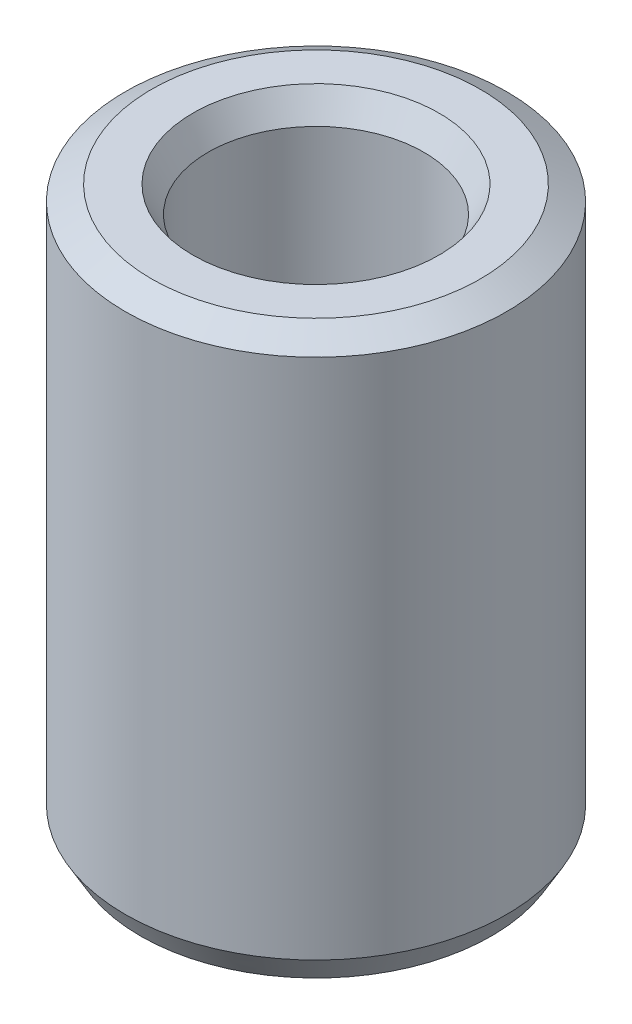
ISO-10303-21;
HEADER;
FILE_DESCRIPTION(('STEP AP214'),'2;1');
FILE_NAME('part.step','',(''),(''),'','','');
FILE_SCHEMA(('AUTOMOTIVE_DESIGN { 1 0 10303 214 1 1 1 1 }'));
ENDSEC;
DATA;
#1=APPLICATION_CONTEXT('core data for automotive mechanical design processes');
#2=APPLICATION_PROTOCOL_DEFINITION('international standard','automotive_design',2000,#1);
#3=PRODUCT_CONTEXT('',#1,'mechanical');
#4=PRODUCT('Part','Part','',(#3));
#5=PRODUCT_RELATED_PRODUCT_CATEGORY('part','',(#4));
#6=PRODUCT_DEFINITION_FORMATION('','',#4);
#7=PRODUCT_DEFINITION_CONTEXT('part definition',#1,'design');
#8=PRODUCT_DEFINITION('design','',#6,#7);
#9=PRODUCT_DEFINITION_SHAPE('','',#8);
#10=(LENGTH_UNIT() NAMED_UNIT(*) SI_UNIT(.MILLI.,.METRE.));
#11=(NAMED_UNIT(*) PLANE_ANGLE_UNIT() SI_UNIT($,.RADIAN.));
#12=(NAMED_UNIT(*) SI_UNIT($,.STERADIAN.) SOLID_ANGLE_UNIT());
#13=UNCERTAINTY_MEASURE_WITH_UNIT(LENGTH_MEASURE(1.E-05),#10,'distance_accuracy_value','');
#14=(GEOMETRIC_REPRESENTATION_CONTEXT(3) GLOBAL_UNCERTAINTY_ASSIGNED_CONTEXT((#13)) GLOBAL_UNIT_ASSIGNED_CONTEXT((#10,
#11,#12)) REPRESENTATION_CONTEXT('',''));
#15=CARTESIAN_POINT('',(0.,0.,0.));
#16=DIRECTION('',(0.,0.,1.));
#17=DIRECTION('',(1.,0.,0.));
#18=AXIS2_PLACEMENT_3D('',#15,#16,#17);
#19=CARTESIAN_POINT('',(0.,22.1694902343943,0.));
#20=DIRECTION('',(0.,-1.,0.));
#21=DIRECTION('',(0.,0.,-1.));
#22=AXIS2_PLACEMENT_3D('',#19,#20,#21);
#23=CYLINDRICAL_SURFACE('',#22,7.5);
#24=CARTESIAN_POINT('',(0.,1.03430108088074,0.));
#25=DIRECTION('',(0.,1.,0.));
#26=DIRECTION('',(0.,0.,1.));
#27=AXIS2_PLACEMENT_3D('',#24,#25,#26);
#28=CIRCLE('',#27,7.5);
#29=CARTESIAN_POINT('',(0.,1.03430108088074,7.5));
#30=VERTEX_POINT('',#29);
#31=EDGE_CURVE('E10',#30,#30,#28,.T.);
#32=ORIENTED_EDGE('',*,*,#31,.T.);
#33=EDGE_LOOP('',(#32));
#34=FACE_BOUND('',#33,.T.);
#35=CARTESIAN_POINT('',(0.,21.5723362269247,0.));
#36=DIRECTION('',(0.,1.,0.));
#37=DIRECTION('',(0.,0.,1.));
#38=AXIS2_PLACEMENT_3D('',#35,#36,#37);
#39=CIRCLE('',#38,7.5);
#40=CARTESIAN_POINT('',(0.,21.5723362269247,7.5));
#41=VERTEX_POINT('',#40);
#42=EDGE_CURVE('E50',#41,#41,#39,.F.);
#43=ORIENTED_EDGE('',*,*,#42,.T.);
#44=EDGE_LOOP('',(#43));
#45=FACE_BOUND('',#44,.T.);
#46=ADVANCED_FACE('F39',(#34,#45),#23,.T.);
#47=CARTESIAN_POINT('',(0.,22.1694902343943,0.));
#48=DIRECTION('',(0.,1.,0.));
#49=DIRECTION('',(0.,0.,1.));
#50=AXIS2_PLACEMENT_3D('',#47,#48,#49);
#51=PLANE('',#50);
#52=CARTESIAN_POINT('',(0.,22.1694902343943,0.));
#53=DIRECTION('',(0.,1.,0.));
#54=DIRECTION('',(0.,0.,1.));
#55=AXIS2_PLACEMENT_3D('',#52,#53,#54);
#56=CIRCLE('',#55,4.84151142337172);
#57=CARTESIAN_POINT('',(0.,22.1694902343943,4.84151142337172));
#58=VERTEX_POINT('',#57);
#59=EDGE_CURVE('E58',#58,#58,#56,.F.);
#60=ORIENTED_EDGE('',*,*,#59,.T.);
#61=EDGE_LOOP('',(#60));
#62=FACE_BOUND('',#61,.T.);
#63=CARTESIAN_POINT('',(0.,22.1694902343943,0.));
#64=DIRECTION('',(0.,1.,0.));
#65=DIRECTION('',(0.,0.,1.));
#66=AXIS2_PLACEMENT_3D('',#63,#64,#65);
#67=CIRCLE('',#66,6.46569891911926);
#68=CARTESIAN_POINT('',(0.,22.1694902343943,6.46569891911926));
#69=VERTEX_POINT('',#68);
#70=EDGE_CURVE('E61',#69,#69,#67,.T.);
#71=ORIENTED_EDGE('',*,*,#70,.T.);
#72=EDGE_LOOP('',(#71));
#73=FACE_BOUND('',#72,.T.);
#74=ADVANCED_FACE('F88',(#62,#73),#51,.T.);
#75=CARTESIAN_POINT('',(0.,0.,0.));
#76=DIRECTION('',(0.,1.,0.));
#77=DIRECTION('',(0.,0.,1.));
#78=AXIS2_PLACEMENT_3D('',#75,#76,#77);
#79=PLANE('',#78);
#80=CARTESIAN_POINT('',(0.,0.,0.));
#81=DIRECTION('',(0.,1.,0.));
#82=DIRECTION('',(0.,0.,1.));
#83=AXIS2_PLACEMENT_3D('',#80,#81,#82);
#84=CIRCLE('',#83,5.27865849678286);
#85=CARTESIAN_POINT('',(0.,0.,5.27865849678286));
#86=VERTEX_POINT('',#85);
#87=EDGE_CURVE('E51',#86,#86,#84,.T.);
#88=ORIENTED_EDGE('',*,*,#87,.T.);
#89=EDGE_LOOP('',(#88));
#90=FACE_BOUND('',#89,.T.);
#91=CARTESIAN_POINT('',(0.,0.,0.));
#92=DIRECTION('',(0.,1.,0.));
#93=DIRECTION('',(0.,0.,1.));
#94=AXIS2_PLACEMENT_3D('',#91,#92,#93);
#95=CIRCLE('',#94,6.90284599253038);
#96=CARTESIAN_POINT('',(0.,0.,6.90284599253038));
#97=VERTEX_POINT('',#96);
#98=EDGE_CURVE('E54',#97,#97,#95,.F.);
#99=ORIENTED_EDGE('',*,*,#98,.T.);
#100=EDGE_LOOP('',(#99));
#101=FACE_BOUND('',#100,.T.);
#102=ADVANCED_FACE('F83',(#90,#101),#79,.F.);
#103=CARTESIAN_POINT('',(0.,22.1694902343943,0.));
#104=DIRECTION('',(0.,-1.,0.));
#105=DIRECTION('',(0.,0.,-1.));
#106=AXIS2_PLACEMENT_3D('',#103,#104,#105);
#107=CYLINDRICAL_SURFACE('',#106,4.24435741590211);
#108=CARTESIAN_POINT('',(0.,21.1351891535136,0.));
#109=DIRECTION('',(0.,1.,0.));
#110=DIRECTION('',(0.,0.,1.));
#111=AXIS2_PLACEMENT_3D('',#108,#109,#110);
#112=CIRCLE('',#111,4.24435741590211);
#113=CARTESIAN_POINT('',(0.,21.1351891535136,4.24435741590211));
#114=VERTEX_POINT('',#113);
#115=EDGE_CURVE('E67',#114,#114,#112,.T.);
#116=ORIENTED_EDGE('',*,*,#115,.T.);
#117=EDGE_LOOP('',(#116));
#118=FACE_BOUND('',#117,.T.);
#119=CARTESIAN_POINT('',(0.,0.597154007469625,0.));
#120=DIRECTION('',(0.,1.,0.));
#121=DIRECTION('',(0.,0.,1.));
#122=AXIS2_PLACEMENT_3D('',#119,#120,#121);
#123=CIRCLE('',#122,4.24435741590211);
#124=CARTESIAN_POINT('',(0.,0.597154007469625,4.24435741590211));
#125=VERTEX_POINT('',#124);
#126=EDGE_CURVE('E69',#125,#125,#123,.F.);
#127=ORIENTED_EDGE('',*,*,#126,.T.);
#128=EDGE_LOOP('',(#127));
#129=FACE_BOUND('',#128,.T.);
#130=ADVANCED_FACE('F71',(#118,#129),#107,.F.);
#131=CARTESIAN_POINT('',(0.,21.1351891535136,0.));
#132=DIRECTION('',(0.,1.,0.));
#133=DIRECTION('',(0.,0.,1.));
#134=AXIS2_PLACEMENT_3D('',#131,#132,#133);
#135=CONICAL_SURFACE('',#134,4.24435741590211,0.523598775598305);
#136=ORIENTED_EDGE('',*,*,#59,.F.);
#137=EDGE_LOOP('',(#136));
#138=FACE_BOUND('',#137,.T.);
#139=ORIENTED_EDGE('',*,*,#115,.F.);
#140=EDGE_LOOP('',(#139));
#141=FACE_BOUND('',#140,.T.);
#142=ADVANCED_FACE('F77',(#138,#141),#135,.F.);
#143=CARTESIAN_POINT('',(0.,0.,0.));
#144=DIRECTION('',(0.,-1.,0.));
#145=DIRECTION('',(0.,0.,-1.));
#146=AXIS2_PLACEMENT_3D('',#143,#144,#145);
#147=CONICAL_SURFACE('',#146,5.27865849678286,1.04719755119659);
#148=ORIENTED_EDGE('',*,*,#126,.F.);
#149=EDGE_LOOP('',(#148));
#150=FACE_BOUND('',#149,.T.);
#151=ORIENTED_EDGE('',*,*,#87,.F.);
#152=EDGE_LOOP('',(#151));
#153=FACE_BOUND('',#152,.T.);
#154=ADVANCED_FACE('F73',(#150,#153),#147,.F.);
#155=CARTESIAN_POINT('',(0.,1.03430108088074,0.));
#156=DIRECTION('',(0.,1.,0.));
#157=DIRECTION('',(0.,0.,1.));
#158=AXIS2_PLACEMENT_3D('',#155,#156,#157);
#159=CONICAL_SURFACE('',#158,7.5,0.523598775598302);
#160=ORIENTED_EDGE('',*,*,#98,.F.);
#161=EDGE_LOOP('',(#160));
#162=FACE_BOUND('',#161,.T.);
#163=ORIENTED_EDGE('',*,*,#31,.F.);
#164=EDGE_LOOP('',(#163));
#165=FACE_BOUND('',#164,.T.);
#166=ADVANCED_FACE('F76',(#162,#165),#159,.T.);
#167=CARTESIAN_POINT('',(0.,22.1694902343943,0.));
#168=DIRECTION('',(0.,-1.,0.));
#169=DIRECTION('',(0.,0.,-1.));
#170=AXIS2_PLACEMENT_3D('',#167,#168,#169);
#171=CONICAL_SURFACE('',#170,6.46569891911926,1.04719755119659);
#172=ORIENTED_EDGE('',*,*,#42,.F.);
#173=EDGE_LOOP('',(#172));
#174=FACE_BOUND('',#173,.T.);
#175=ORIENTED_EDGE('',*,*,#70,.F.);
#176=EDGE_LOOP('',(#175));
#177=FACE_BOUND('',#176,.T.);
#178=ADVANCED_FACE('F45',(#174,#177),#171,.T.);
#179=CLOSED_SHELL('',(#46,#74,#102,#130,#142,#154,#166,#178));
#180=MANIFOLD_SOLID_BREP('B2',#179);
#181=ADVANCED_BREP_SHAPE_REPRESENTATION('',(#18,#180),#14);
#182=SHAPE_DEFINITION_REPRESENTATION(#9,#181);
ENDSEC;
END-ISO-10303-21;
